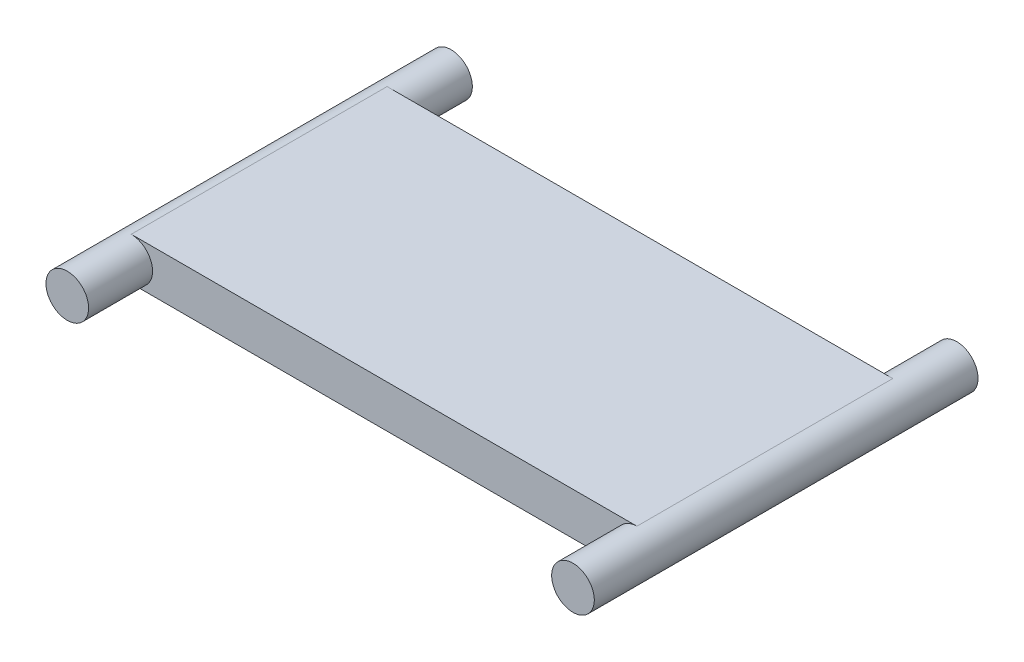
ISO-10303-21;
HEADER;
FILE_DESCRIPTION(('STEP AP214'),'2;1');
FILE_NAME('part.step','',(''),(''),'','','');
FILE_SCHEMA(('AUTOMOTIVE_DESIGN { 1 0 10303 214 1 1 1 1 }'));
ENDSEC;
DATA;
#1=APPLICATION_CONTEXT('core data for automotive mechanical design processes');
#2=APPLICATION_PROTOCOL_DEFINITION('international standard','automotive_design',2000,#1);
#3=PRODUCT_CONTEXT('',#1,'mechanical');
#4=PRODUCT('Part','Part','',(#3));
#5=PRODUCT_RELATED_PRODUCT_CATEGORY('part','',(#4));
#6=PRODUCT_DEFINITION_FORMATION('','',#4);
#7=PRODUCT_DEFINITION_CONTEXT('part definition',#1,'design');
#8=PRODUCT_DEFINITION('design','',#6,#7);
#9=PRODUCT_DEFINITION_SHAPE('','',#8);
#10=(LENGTH_UNIT() NAMED_UNIT(*) SI_UNIT(.MILLI.,.METRE.));
#11=(NAMED_UNIT(*) PLANE_ANGLE_UNIT() SI_UNIT($,.RADIAN.));
#12=(NAMED_UNIT(*) SI_UNIT($,.STERADIAN.) SOLID_ANGLE_UNIT());
#13=UNCERTAINTY_MEASURE_WITH_UNIT(LENGTH_MEASURE(1.E-05),#10,'distance_accuracy_value','');
#14=(GEOMETRIC_REPRESENTATION_CONTEXT(3) GLOBAL_UNCERTAINTY_ASSIGNED_CONTEXT((#13)) GLOBAL_UNIT_ASSIGNED_CONTEXT((#10,
#11,#12)) REPRESENTATION_CONTEXT('',''));
#15=CARTESIAN_POINT('',(0.,0.,0.));
#16=DIRECTION('',(0.,0.,1.));
#17=DIRECTION('',(1.,0.,0.));
#18=AXIS2_PLACEMENT_3D('',#15,#16,#17);
#19=CARTESIAN_POINT('',(18.82775,0.,9.525));
#20=DIRECTION('',(0.,0.,-1.));
#21=DIRECTION('',(-1.,0.,0.));
#22=AXIS2_PLACEMENT_3D('',#19,#20,#21);
#23=CYLINDRICAL_SURFACE('',#22,1.5875);
#24=DIRECTION('',(0.,0.,-1.));
#25=VECTOR('',#24,1.);
#26=CARTESIAN_POINT('',(18.82775,-1.5875,9.525));
#27=LINE('',#26,#25);
#28=CARTESIAN_POINT('',(18.82775,-1.5875,9.525));
#29=VERTEX_POINT('',#28);
#30=CARTESIAN_POINT('',(18.82775,-1.5875,-9.525));
#31=VERTEX_POINT('',#30);
#32=EDGE_CURVE('E86',#29,#31,#27,.T.);
#33=ORIENTED_EDGE('',*,*,#32,.T.);
#34=CARTESIAN_POINT('',(18.82775,0.,-9.525));
#35=DIRECTION('',(0.,0.,-1.));
#36=DIRECTION('',(-1.,0.,0.));
#37=AXIS2_PLACEMENT_3D('',#34,#35,#36);
#38=CIRCLE('',#37,1.5875);
#39=CARTESIAN_POINT('',(18.82775,1.5875,-9.525));
#40=VERTEX_POINT('',#39);
#41=EDGE_CURVE('E40',#31,#40,#38,.T.);
#42=ORIENTED_EDGE('',*,*,#41,.T.);
#43=DIRECTION('',(0.,0.,-1.));
#44=VECTOR('',#43,1.);
#45=CARTESIAN_POINT('',(18.82775,1.5875,9.525));
#46=LINE('',#45,#44);
#47=CARTESIAN_POINT('',(18.82775,1.5875,9.525));
#48=VERTEX_POINT('',#47);
#49=EDGE_CURVE('E115',#48,#40,#46,.T.);
#50=ORIENTED_EDGE('',*,*,#49,.F.);
#51=CARTESIAN_POINT('',(18.82775,0.,9.525));
#52=DIRECTION('',(0.,0.,1.));
#53=DIRECTION('',(1.,0.,0.));
#54=AXIS2_PLACEMENT_3D('',#51,#52,#53);
#55=CIRCLE('',#54,1.5875);
#56=EDGE_CURVE('E111',#48,#29,#55,.T.);
#57=ORIENTED_EDGE('',*,*,#56,.T.);
#58=EDGE_LOOP('',(#33,#42,#50,#57));
#59=FACE_BOUND('',#58,.T.);
#60=CARTESIAN_POINT('',(18.82775,0.,14.2875));
#61=DIRECTION('',(0.,0.,-1.));
#62=DIRECTION('',(-1.,0.,0.));
#63=AXIS2_PLACEMENT_3D('',#60,#61,#62);
#64=CIRCLE('',#63,1.5875);
#65=CARTESIAN_POINT('',(17.24025,0.,14.2875));
#66=VERTEX_POINT('',#65);
#67=EDGE_CURVE('E130',#66,#66,#64,.T.);
#68=ORIENTED_EDGE('',*,*,#67,.T.);
#69=EDGE_LOOP('',(#68));
#70=FACE_BOUND('',#69,.T.);
#71=CARTESIAN_POINT('',(18.82775,0.,-14.2875));
#72=DIRECTION('',(0.,0.,-1.));
#73=DIRECTION('',(-1.,0.,0.));
#74=AXIS2_PLACEMENT_3D('',#71,#72,#73);
#75=CIRCLE('',#74,1.5875);
#76=CARTESIAN_POINT('',(17.24025,0.,-14.2875));
#77=VERTEX_POINT('',#76);
#78=EDGE_CURVE('E133',#77,#77,#75,.T.);
#79=ORIENTED_EDGE('',*,*,#78,.F.);
#80=EDGE_LOOP('',(#79));
#81=FACE_BOUND('',#80,.T.);
#82=ADVANCED_FACE('F32',(#59,#70,#81),#23,.T.);
#83=CARTESIAN_POINT('',(-18.82775,1.5875,9.525));
#84=DIRECTION('',(0.,-1.,0.));
#85=DIRECTION('',(0.,0.,-1.));
#86=AXIS2_PLACEMENT_3D('',#83,#84,#85);
#87=PLANE('',#86);
#88=DIRECTION('',(-1.,0.,0.));
#89=VECTOR('',#88,1.);
#90=CARTESIAN_POINT('',(-18.82775,1.5875,-9.525));
#91=LINE('',#90,#89);
#92=CARTESIAN_POINT('',(-18.82775,1.5875,-9.525));
#93=VERTEX_POINT('',#92);
#94=EDGE_CURVE('E91',#40,#93,#91,.T.);
#95=ORIENTED_EDGE('',*,*,#94,.T.);
#96=DIRECTION('',(0.,0.,-1.));
#97=VECTOR('',#96,1.);
#98=CARTESIAN_POINT('',(-18.82775,1.5875,9.525));
#99=LINE('',#98,#97);
#100=CARTESIAN_POINT('',(-18.82775,1.5875,9.525));
#101=VERTEX_POINT('',#100);
#102=EDGE_CURVE('E65',#101,#93,#99,.T.);
#103=ORIENTED_EDGE('',*,*,#102,.F.);
#104=DIRECTION('',(-1.,0.,0.));
#105=VECTOR('',#104,1.);
#106=CARTESIAN_POINT('',(-18.82775,1.5875,9.525));
#107=LINE('',#106,#105);
#108=EDGE_CURVE('E90',#48,#101,#107,.T.);
#109=ORIENTED_EDGE('',*,*,#108,.F.);
#110=ORIENTED_EDGE('',*,*,#49,.T.);
#111=EDGE_LOOP('',(#95,#103,#109,#110));
#112=FACE_BOUND('',#111,.T.);
#113=ADVANCED_FACE('F152',(#112),#87,.F.);
#114=CARTESIAN_POINT('',(-18.82775,0.,9.525));
#115=DIRECTION('',(0.,0.,-1.));
#116=DIRECTION('',(-1.,0.,0.));
#117=AXIS2_PLACEMENT_3D('',#114,#115,#116);
#118=CYLINDRICAL_SURFACE('',#117,1.5875);
#119=ORIENTED_EDGE('',*,*,#102,.T.);
#120=CARTESIAN_POINT('',(-18.82775,0.,-9.525));
#121=DIRECTION('',(0.,0.,1.));
#122=DIRECTION('',(1.,0.,0.));
#123=AXIS2_PLACEMENT_3D('',#120,#121,#122);
#124=CIRCLE('',#123,1.5875);
#125=CARTESIAN_POINT('',(-18.82775,-1.5875,-9.525));
#126=VERTEX_POINT('',#125);
#127=EDGE_CURVE('E11',#126,#93,#124,.T.);
#128=ORIENTED_EDGE('',*,*,#127,.F.);
#129=DIRECTION('',(0.,0.,-1.));
#130=VECTOR('',#129,1.);
#131=CARTESIAN_POINT('',(-18.82775,-1.5875,9.525));
#132=LINE('',#131,#130);
#133=CARTESIAN_POINT('',(-18.82775,-1.5875,9.525));
#134=VERTEX_POINT('',#133);
#135=EDGE_CURVE('E80',#134,#126,#132,.T.);
#136=ORIENTED_EDGE('',*,*,#135,.F.);
#137=CARTESIAN_POINT('',(-18.82775,0.,9.525));
#138=DIRECTION('',(0.,0.,1.));
#139=DIRECTION('',(1.,0.,0.));
#140=AXIS2_PLACEMENT_3D('',#137,#138,#139);
#141=CIRCLE('',#140,1.5875);
#142=EDGE_CURVE('E112',#134,#101,#141,.T.);
#143=ORIENTED_EDGE('',*,*,#142,.T.);
#144=EDGE_LOOP('',(#119,#128,#136,#143));
#145=FACE_BOUND('',#144,.T.);
#146=CARTESIAN_POINT('',(-18.82775,0.,14.2875));
#147=DIRECTION('',(0.,0.,1.));
#148=DIRECTION('',(1.,0.,0.));
#149=AXIS2_PLACEMENT_3D('',#146,#147,#148);
#150=CIRCLE('',#149,1.5875);
#151=CARTESIAN_POINT('',(-17.24025,0.,14.2875));
#152=VERTEX_POINT('',#151);
#153=EDGE_CURVE('E94',#152,#152,#150,.T.);
#154=ORIENTED_EDGE('',*,*,#153,.F.);
#155=EDGE_LOOP('',(#154));
#156=FACE_BOUND('',#155,.T.);
#157=CARTESIAN_POINT('',(-18.82775,0.,-14.2875));
#158=DIRECTION('',(0.,0.,1.));
#159=DIRECTION('',(1.,0.,0.));
#160=AXIS2_PLACEMENT_3D('',#157,#158,#159);
#161=CIRCLE('',#160,1.5875);
#162=CARTESIAN_POINT('',(-17.24025,0.,-14.2875));
#163=VERTEX_POINT('',#162);
#164=EDGE_CURVE('E136',#163,#163,#161,.T.);
#165=ORIENTED_EDGE('',*,*,#164,.T.);
#166=EDGE_LOOP('',(#165));
#167=FACE_BOUND('',#166,.T.);
#168=ADVANCED_FACE('F77',(#145,#156,#167),#118,.T.);
#169=CARTESIAN_POINT('',(-18.82775,-1.5875,9.525));
#170=DIRECTION('',(0.,1.,0.));
#171=DIRECTION('',(0.,0.,1.));
#172=AXIS2_PLACEMENT_3D('',#169,#170,#171);
#173=PLANE('',#172);
#174=DIRECTION('',(1.,0.,0.));
#175=VECTOR('',#174,1.);
#176=CARTESIAN_POINT('',(-18.82775,-1.5875,-9.525));
#177=LINE('',#176,#175);
#178=EDGE_CURVE('E84',#126,#31,#177,.T.);
#179=ORIENTED_EDGE('',*,*,#178,.T.);
#180=ORIENTED_EDGE('',*,*,#32,.F.);
#181=DIRECTION('',(1.,0.,0.));
#182=VECTOR('',#181,1.);
#183=CARTESIAN_POINT('',(-18.82775,-1.5875,9.525));
#184=LINE('',#183,#182);
#185=EDGE_CURVE('E48',#134,#29,#184,.T.);
#186=ORIENTED_EDGE('',*,*,#185,.F.);
#187=ORIENTED_EDGE('',*,*,#135,.T.);
#188=EDGE_LOOP('',(#179,#180,#186,#187));
#189=FACE_BOUND('',#188,.T.);
#190=ADVANCED_FACE('F83',(#189),#173,.F.);
#191=CARTESIAN_POINT('',(18.82775,0.,9.525));
#192=DIRECTION('',(0.,0.,1.));
#193=DIRECTION('',(1.,0.,0.));
#194=AXIS2_PLACEMENT_3D('',#191,#192,#193);
#195=PLANE('',#194);
#196=ORIENTED_EDGE('',*,*,#56,.F.);
#197=ORIENTED_EDGE('',*,*,#108,.T.);
#198=ORIENTED_EDGE('',*,*,#142,.F.);
#199=ORIENTED_EDGE('',*,*,#185,.T.);
#200=EDGE_LOOP('',(#196,#197,#198,#199));
#201=FACE_BOUND('',#200,.T.);
#202=ADVANCED_FACE('F170',(#201),#195,.T.);
#203=CARTESIAN_POINT('',(18.82775,0.,-9.525));
#204=DIRECTION('',(0.,0.,1.));
#205=DIRECTION('',(1.,0.,0.));
#206=AXIS2_PLACEMENT_3D('',#203,#204,#205);
#207=PLANE('',#206);
#208=ORIENTED_EDGE('',*,*,#178,.F.);
#209=ORIENTED_EDGE('',*,*,#127,.T.);
#210=ORIENTED_EDGE('',*,*,#94,.F.);
#211=ORIENTED_EDGE('',*,*,#41,.F.);
#212=EDGE_LOOP('',(#208,#209,#210,#211));
#213=FACE_BOUND('',#212,.T.);
#214=ADVANCED_FACE('F88',(#213),#207,.F.);
#215=CARTESIAN_POINT('',(-18.82775,0.,14.2875));
#216=DIRECTION('',(0.,0.,1.));
#217=DIRECTION('',(1.,0.,0.));
#218=AXIS2_PLACEMENT_3D('',#215,#216,#217);
#219=PLANE('',#218);
#220=ORIENTED_EDGE('',*,*,#153,.T.);
#221=EDGE_LOOP('',(#220));
#222=FACE_BOUND('',#221,.T.);
#223=ADVANCED_FACE('F162',(#222),#219,.T.);
#224=CARTESIAN_POINT('',(18.82775,0.,14.2875));
#225=DIRECTION('',(0.,0.,1.));
#226=DIRECTION('',(-1.,0.,0.));
#227=AXIS2_PLACEMENT_3D('',#224,#225,#226);
#228=PLANE('',#227);
#229=ORIENTED_EDGE('',*,*,#67,.F.);
#230=EDGE_LOOP('',(#229));
#231=FACE_BOUND('',#230,.T.);
#232=ADVANCED_FACE('F148',(#231),#228,.T.);
#233=CARTESIAN_POINT('',(18.82775,0.,-14.2875));
#234=DIRECTION('',(0.,0.,-1.));
#235=DIRECTION('',(-1.,0.,0.));
#236=AXIS2_PLACEMENT_3D('',#233,#234,#235);
#237=PLANE('',#236);
#238=ORIENTED_EDGE('',*,*,#78,.T.);
#239=EDGE_LOOP('',(#238));
#240=FACE_BOUND('',#239,.T.);
#241=ADVANCED_FACE('F143',(#240),#237,.T.);
#242=CARTESIAN_POINT('',(-18.82775,0.,-14.2875));
#243=DIRECTION('',(0.,0.,-1.));
#244=DIRECTION('',(1.,0.,0.));
#245=AXIS2_PLACEMENT_3D('',#242,#243,#244);
#246=PLANE('',#245);
#247=ORIENTED_EDGE('',*,*,#164,.F.);
#248=EDGE_LOOP('',(#247));
#249=FACE_BOUND('',#248,.T.);
#250=ADVANCED_FACE('F141',(#249),#246,.T.);
#251=CLOSED_SHELL('',(#82,#113,#168,#190,#202,#214,#223,#232,#241,#250));
#252=MANIFOLD_SOLID_BREP('B2',#251);
#253=ADVANCED_BREP_SHAPE_REPRESENTATION('',(#18,#252),#14);
#254=SHAPE_DEFINITION_REPRESENTATION(#9,#253);
ENDSEC;
END-ISO-10303-21;
